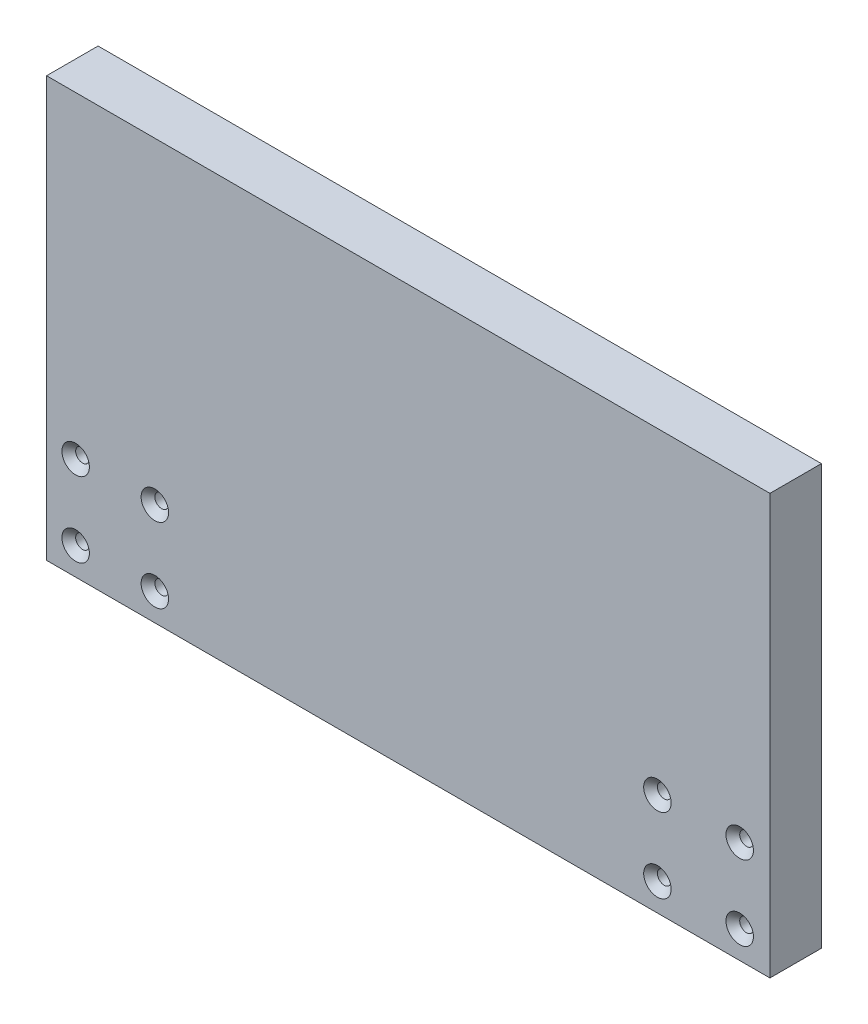
ISO-10303-21;
HEADER;
FILE_DESCRIPTION(('STEP AP214'),'2;1');
FILE_NAME('part.step','',(''),(''),'','','');
FILE_SCHEMA(('AUTOMOTIVE_DESIGN { 1 0 10303 214 1 1 1 1 }'));
ENDSEC;
DATA;
#1=APPLICATION_CONTEXT('core data for automotive mechanical design processes');
#2=APPLICATION_PROTOCOL_DEFINITION('international standard','automotive_design',2000,#1);
#3=PRODUCT_CONTEXT('',#1,'mechanical');
#4=PRODUCT('Part','Part','',(#3));
#5=PRODUCT_RELATED_PRODUCT_CATEGORY('part','',(#4));
#6=PRODUCT_DEFINITION_FORMATION('','',#4);
#7=PRODUCT_DEFINITION_CONTEXT('part definition',#1,'design');
#8=PRODUCT_DEFINITION('design','',#6,#7);
#9=PRODUCT_DEFINITION_SHAPE('','',#8);
#10=(LENGTH_UNIT() NAMED_UNIT(*) SI_UNIT(.MILLI.,.METRE.));
#11=(NAMED_UNIT(*) PLANE_ANGLE_UNIT() SI_UNIT($,.RADIAN.));
#12=(NAMED_UNIT(*) SI_UNIT($,.STERADIAN.) SOLID_ANGLE_UNIT());
#13=UNCERTAINTY_MEASURE_WITH_UNIT(LENGTH_MEASURE(1.E-05),#10,'distance_accuracy_value','');
#14=(GEOMETRIC_REPRESENTATION_CONTEXT(3) GLOBAL_UNCERTAINTY_ASSIGNED_CONTEXT((#13)) GLOBAL_UNIT_ASSIGNED_CONTEXT((#10,
#11,#12)) REPRESENTATION_CONTEXT('',''));
#15=CARTESIAN_POINT('',(0.,0.,0.));
#16=DIRECTION('',(0.,0.,1.));
#17=DIRECTION('',(1.,0.,0.));
#18=AXIS2_PLACEMENT_3D('',#15,#16,#17);
#19=CARTESIAN_POINT('',(-188.874999999999,0.,-25.4));
#20=DIRECTION('',(-1.,0.,0.));
#21=DIRECTION('',(0.,0.,1.));
#22=AXIS2_PLACEMENT_3D('',#19,#20,#21);
#23=PLANE('',#22);
#24=DIRECTION('',(0.,0.,1.));
#25=VECTOR('',#24,1.);
#26=CARTESIAN_POINT('',(-188.874999999999,194.1,-25.4));
#27=LINE('',#26,#25);
#28=CARTESIAN_POINT('',(-188.874999999999,194.1,-23.8125));
#29=VERTEX_POINT('',#28);
#30=CARTESIAN_POINT('',(-188.874999999999,194.1,0.));
#31=VERTEX_POINT('',#30);
#32=EDGE_CURVE('E135',#29,#31,#27,.T.);
#33=ORIENTED_EDGE('',*,*,#32,.F.);
#34=DIRECTION('',(0.,-1.,0.));
#35=VECTOR('',#34,1.);
#36=CARTESIAN_POINT('',(-188.874999999999,-3.86760644354291E-13,-23.8125));
#37=LINE('',#36,#35);
#38=CARTESIAN_POINT('',(-188.874999999999,-3.86760644354291E-13,-23.8125));
#39=VERTEX_POINT('',#38);
#40=EDGE_CURVE('E104',#29,#39,#37,.T.);
#41=ORIENTED_EDGE('',*,*,#40,.T.);
#42=DIRECTION('',(0.,0.,1.));
#43=VECTOR('',#42,1.);
#44=CARTESIAN_POINT('',(-188.874999999999,-3.86760644354291E-13,-25.4));
#45=LINE('',#44,#43);
#46=CARTESIAN_POINT('',(-188.874999999999,-3.86760644354291E-13,0.));
#47=VERTEX_POINT('',#46);
#48=EDGE_CURVE('E97',#39,#47,#45,.T.);
#49=ORIENTED_EDGE('',*,*,#48,.T.);
#50=DIRECTION('',(0.,-1.,0.));
#51=VECTOR('',#50,1.);
#52=CARTESIAN_POINT('',(-188.874999999999,0.,0.));
#53=LINE('',#52,#51);
#54=EDGE_CURVE('E101',#31,#47,#53,.T.);
#55=ORIENTED_EDGE('',*,*,#54,.F.);
#56=EDGE_LOOP('',(#33,#41,#49,#55));
#57=FACE_BOUND('',#56,.T.);
#58=ADVANCED_FACE('F41',(#57),#23,.T.);
#59=CARTESIAN_POINT('',(0.,194.1,-25.4));
#60=DIRECTION('',(0.,1.,0.));
#61=DIRECTION('',(-1.,0.,0.));
#62=AXIS2_PLACEMENT_3D('',#59,#60,#61);
#63=PLANE('',#62);
#64=DIRECTION('',(0.,0.,1.));
#65=VECTOR('',#64,1.);
#66=CARTESIAN_POINT('',(145.625,194.1,-25.4));
#67=LINE('',#66,#65);
#68=CARTESIAN_POINT('',(145.625,194.1,-23.8125));
#69=VERTEX_POINT('',#68);
#70=CARTESIAN_POINT('',(145.625,194.1,0.));
#71=VERTEX_POINT('',#70);
#72=EDGE_CURVE('E139',#69,#71,#67,.T.);
#73=ORIENTED_EDGE('',*,*,#72,.F.);
#74=DIRECTION('',(-1.,0.,0.));
#75=VECTOR('',#74,1.);
#76=CARTESIAN_POINT('',(-188.874999999999,194.1,-23.8125));
#77=LINE('',#76,#75);
#78=EDGE_CURVE('E11',#69,#29,#77,.T.);
#79=ORIENTED_EDGE('',*,*,#78,.T.);
#80=ORIENTED_EDGE('',*,*,#32,.T.);
#81=DIRECTION('',(-1.,0.,0.));
#82=VECTOR('',#81,1.);
#83=CARTESIAN_POINT('',(0.,194.1,0.));
#84=LINE('',#83,#82);
#85=EDGE_CURVE('E107',#71,#31,#84,.T.);
#86=ORIENTED_EDGE('',*,*,#85,.F.);
#87=EDGE_LOOP('',(#73,#79,#80,#86));
#88=FACE_BOUND('',#87,.T.);
#89=ADVANCED_FACE('F320',(#88),#63,.T.);
#90=CARTESIAN_POINT('',(145.625,0.,-25.4));
#91=DIRECTION('',(1.,0.,0.));
#92=DIRECTION('',(0.,0.,-1.));
#93=AXIS2_PLACEMENT_3D('',#90,#91,#92);
#94=PLANE('',#93);
#95=DIRECTION('',(0.,0.,1.));
#96=VECTOR('',#95,1.);
#97=CARTESIAN_POINT('',(145.625,0.,-25.4));
#98=LINE('',#97,#96);
#99=CARTESIAN_POINT('',(145.625,0.,-23.8125));
#100=VERTEX_POINT('',#99);
#101=CARTESIAN_POINT('',(145.625,0.,0.));
#102=VERTEX_POINT('',#101);
#103=EDGE_CURVE('E106',#100,#102,#98,.T.);
#104=ORIENTED_EDGE('',*,*,#103,.F.);
#105=DIRECTION('',(0.,1.,0.));
#106=VECTOR('',#105,1.);
#107=CARTESIAN_POINT('',(145.625,194.1,-23.8125));
#108=LINE('',#107,#106);
#109=EDGE_CURVE('E52',#100,#69,#108,.T.);
#110=ORIENTED_EDGE('',*,*,#109,.T.);
#111=ORIENTED_EDGE('',*,*,#72,.T.);
#112=DIRECTION('',(0.,1.,0.));
#113=VECTOR('',#112,1.);
#114=CARTESIAN_POINT('',(145.625,0.,0.));
#115=LINE('',#114,#113);
#116=EDGE_CURVE('E116',#102,#71,#115,.T.);
#117=ORIENTED_EDGE('',*,*,#116,.F.);
#118=EDGE_LOOP('',(#104,#110,#111,#117));
#119=FACE_BOUND('',#118,.T.);
#120=ADVANCED_FACE('F325',(#119),#94,.T.);
#121=CARTESIAN_POINT('',(0.,0.,-25.4));
#122=DIRECTION('',(0.,1.,0.));
#123=DIRECTION('',(0.,0.,1.));
#124=AXIS2_PLACEMENT_3D('',#121,#122,#123);
#125=PLANE('',#124);
#126=ORIENTED_EDGE('',*,*,#48,.F.);
#127=DIRECTION('',(1.,0.,0.));
#128=VECTOR('',#127,1.);
#129=CARTESIAN_POINT('',(0.,0.,-23.8125));
#130=LINE('',#129,#128);
#131=EDGE_CURVE('E67',#39,#100,#130,.T.);
#132=ORIENTED_EDGE('',*,*,#131,.T.);
#133=ORIENTED_EDGE('',*,*,#103,.T.);
#134=DIRECTION('',(-1.,0.,0.));
#135=VECTOR('',#134,1.);
#136=CARTESIAN_POINT('',(0.,0.,0.));
#137=LINE('',#136,#135);
#138=EDGE_CURVE('E110',#102,#47,#137,.T.);
#139=ORIENTED_EDGE('',*,*,#138,.T.);
#140=EDGE_LOOP('',(#126,#132,#133,#139));
#141=FACE_BOUND('',#140,.T.);
#142=ADVANCED_FACE('F111',(#141),#125,.F.);
#143=CARTESIAN_POINT('',(0.,0.,-25.4));
#144=DIRECTION('',(0.,0.,1.));
#145=DIRECTION('',(1.,0.,0.));
#146=AXIS2_PLACEMENT_3D('',#143,#144,#145);
#147=PLANE('',#146);
#148=DIRECTION('',(-1.,0.,0.));
#149=VECTOR('',#148,1.);
#150=CARTESIAN_POINT('',(0.,1.58749999999991,-25.4));
#151=LINE('',#150,#149);
#152=CARTESIAN_POINT('',(144.0375,1.58749999999991,-25.4));
#153=VERTEX_POINT('',#152);
#154=CARTESIAN_POINT('',(-187.287499999999,1.58749999999991,-25.4));
#155=VERTEX_POINT('',#154);
#156=EDGE_CURVE('E215',#153,#155,#151,.T.);
#157=ORIENTED_EDGE('',*,*,#156,.T.);
#158=DIRECTION('',(0.,1.,0.));
#159=VECTOR('',#158,1.);
#160=CARTESIAN_POINT('',(-187.287499999999,194.1,-25.4));
#161=LINE('',#160,#159);
#162=CARTESIAN_POINT('',(-187.287499999999,192.5125,-25.4));
#163=VERTEX_POINT('',#162);
#164=EDGE_CURVE('E218',#155,#163,#161,.T.);
#165=ORIENTED_EDGE('',*,*,#164,.T.);
#166=DIRECTION('',(1.,0.,0.));
#167=VECTOR('',#166,1.);
#168=CARTESIAN_POINT('',(145.625,192.5125,-25.4));
#169=LINE('',#168,#167);
#170=CARTESIAN_POINT('',(144.0375,192.5125,-25.4));
#171=VERTEX_POINT('',#170);
#172=EDGE_CURVE('E209',#163,#171,#169,.T.);
#173=ORIENTED_EDGE('',*,*,#172,.T.);
#174=DIRECTION('',(0.,-1.,0.));
#175=VECTOR('',#174,1.);
#176=CARTESIAN_POINT('',(144.0375,0.,-25.4));
#177=LINE('',#176,#175);
#178=EDGE_CURVE('E212',#171,#153,#177,.T.);
#179=ORIENTED_EDGE('',*,*,#178,.T.);
#180=EDGE_LOOP('',(#157,#165,#173,#179));
#181=FACE_BOUND('',#180,.T.);
#182=CARTESIAN_POINT('',(131.655,12.7,-25.4));
#183=DIRECTION('',(0.,0.,1.));
#184=DIRECTION('',(1.,0.,0.));
#185=AXIS2_PLACEMENT_3D('',#182,#183,#184);
#186=CIRCLE('',#185,3.175);
#187=CARTESIAN_POINT('',(134.83,12.7,-25.4));
#188=VERTEX_POINT('',#187);
#189=EDGE_CURVE('E261',#188,#188,#186,.T.);
#190=ORIENTED_EDGE('',*,*,#189,.T.);
#191=EDGE_LOOP('',(#190));
#192=FACE_BOUND('',#191,.T.);
#193=CARTESIAN_POINT('',(93.5950000000005,47.3000000000001,-25.4));
#194=DIRECTION('',(0.,0.,1.));
#195=DIRECTION('',(1.,0.,0.));
#196=AXIS2_PLACEMENT_3D('',#193,#194,#195);
#197=CIRCLE('',#196,3.175);
#198=CARTESIAN_POINT('',(96.7700000000005,47.3000000000001,-25.4));
#199=VERTEX_POINT('',#198);
#200=EDGE_CURVE('E256',#199,#199,#197,.T.);
#201=ORIENTED_EDGE('',*,*,#200,.T.);
#202=EDGE_LOOP('',(#201));
#203=FACE_BOUND('',#202,.T.);
#204=CARTESIAN_POINT('',(131.655,47.3000000000001,-25.4));
#205=DIRECTION('',(0.,0.,1.));
#206=DIRECTION('',(1.,0.,0.));
#207=AXIS2_PLACEMENT_3D('',#204,#205,#206);
#208=CIRCLE('',#207,3.175);
#209=CARTESIAN_POINT('',(134.83,47.3000000000001,-25.4));
#210=VERTEX_POINT('',#209);
#211=EDGE_CURVE('E260',#210,#210,#208,.T.);
#212=ORIENTED_EDGE('',*,*,#211,.T.);
#213=EDGE_LOOP('',(#212));
#214=FACE_BOUND('',#213,.T.);
#215=CARTESIAN_POINT('',(-138.815833333333,12.7,-25.4));
#216=DIRECTION('',(0.,0.,1.));
#217=DIRECTION('',(1.,0.,0.));
#218=AXIS2_PLACEMENT_3D('',#215,#216,#217);
#219=CIRCLE('',#218,3.175);
#220=CARTESIAN_POINT('',(-135.640833333333,12.7,-25.4));
#221=VERTEX_POINT('',#220);
#222=EDGE_CURVE('E265',#221,#221,#219,.T.);
#223=ORIENTED_EDGE('',*,*,#222,.T.);
#224=EDGE_LOOP('',(#223));
#225=FACE_BOUND('',#224,.T.);
#226=CARTESIAN_POINT('',(93.5950000000005,12.7,-25.4));
#227=DIRECTION('',(0.,0.,1.));
#228=DIRECTION('',(1.,0.,0.));
#229=AXIS2_PLACEMENT_3D('',#226,#227,#228);
#230=CIRCLE('',#229,3.175);
#231=CARTESIAN_POINT('',(96.7700000000005,12.7,-25.4));
#232=VERTEX_POINT('',#231);
#233=EDGE_CURVE('E252',#232,#232,#230,.T.);
#234=ORIENTED_EDGE('',*,*,#233,.T.);
#235=EDGE_LOOP('',(#234));
#236=FACE_BOUND('',#235,.T.);
#237=CARTESIAN_POINT('',(-175.434166666666,12.7,-25.4));
#238=DIRECTION('',(0.,0.,1.));
#239=DIRECTION('',(1.,0.,0.));
#240=AXIS2_PLACEMENT_3D('',#237,#238,#239);
#241=CIRCLE('',#240,3.175);
#242=CARTESIAN_POINT('',(-172.259166666666,12.7,-25.4));
#243=VERTEX_POINT('',#242);
#244=EDGE_CURVE('E246',#243,#243,#241,.T.);
#245=ORIENTED_EDGE('',*,*,#244,.T.);
#246=EDGE_LOOP('',(#245));
#247=FACE_BOUND('',#246,.T.);
#248=CARTESIAN_POINT('',(-175.434166666666,47.3000000000001,-25.4));
#249=DIRECTION('',(0.,0.,1.));
#250=DIRECTION('',(1.,0.,0.));
#251=AXIS2_PLACEMENT_3D('',#248,#249,#250);
#252=CIRCLE('',#251,3.175);
#253=CARTESIAN_POINT('',(-172.259166666666,47.3000000000001,-25.4));
#254=VERTEX_POINT('',#253);
#255=EDGE_CURVE('E239',#254,#254,#252,.T.);
#256=ORIENTED_EDGE('',*,*,#255,.T.);
#257=EDGE_LOOP('',(#256));
#258=FACE_BOUND('',#257,.T.);
#259=CARTESIAN_POINT('',(-138.815833333333,47.3000000000001,-25.4));
#260=DIRECTION('',(0.,0.,1.));
#261=DIRECTION('',(1.,0.,0.));
#262=AXIS2_PLACEMENT_3D('',#259,#260,#261);
#263=CIRCLE('',#262,3.175);
#264=CARTESIAN_POINT('',(-135.640833333333,47.3000000000001,-25.4));
#265=VERTEX_POINT('',#264);
#266=EDGE_CURVE('E269',#265,#265,#263,.T.);
#267=ORIENTED_EDGE('',*,*,#266,.T.);
#268=EDGE_LOOP('',(#267));
#269=FACE_BOUND('',#268,.T.);
#270=CARTESIAN_POINT('',(-112.875,30.0000000000001,-25.4));
#271=DIRECTION('',(0.,0.,1.));
#272=DIRECTION('',(1.,0.,0.));
#273=AXIS2_PLACEMENT_3D('',#270,#271,#272);
#274=CIRCLE('',#273,1.75);
#275=CARTESIAN_POINT('',(-111.125,30.0000000000001,-25.4));
#276=VERTEX_POINT('',#275);
#277=EDGE_CURVE('E125',#276,#276,#274,.T.);
#278=ORIENTED_EDGE('',*,*,#277,.T.);
#279=EDGE_LOOP('',(#278));
#280=FACE_BOUND('',#279,.T.);
#281=CARTESIAN_POINT('',(-52.8749999999997,30.0000000000001,-25.4));
#282=DIRECTION('',(0.,0.,1.));
#283=DIRECTION('',(1.,0.,0.));
#284=AXIS2_PLACEMENT_3D('',#281,#282,#283);
#285=CIRCLE('',#284,1.75);
#286=CARTESIAN_POINT('',(-51.1249999999997,30.0000000000001,-25.4));
#287=VERTEX_POINT('',#286);
#288=EDGE_CURVE('E283',#287,#287,#285,.T.);
#289=ORIENTED_EDGE('',*,*,#288,.T.);
#290=EDGE_LOOP('',(#289));
#291=FACE_BOUND('',#290,.T.);
#292=CARTESIAN_POINT('',(7.12500000000027,30.0000000000001,-25.4));
#293=DIRECTION('',(0.,0.,1.));
#294=DIRECTION('',(1.,0.,0.));
#295=AXIS2_PLACEMENT_3D('',#292,#293,#294);
#296=CIRCLE('',#295,1.75);
#297=CARTESIAN_POINT('',(8.87500000000027,30.0000000000001,-25.4));
#298=VERTEX_POINT('',#297);
#299=EDGE_CURVE('E291',#298,#298,#296,.T.);
#300=ORIENTED_EDGE('',*,*,#299,.T.);
#301=EDGE_LOOP('',(#300));
#302=FACE_BOUND('',#301,.T.);
#303=CARTESIAN_POINT('',(67.1250000000003,30.0000000000001,-25.4));
#304=DIRECTION('',(0.,0.,1.));
#305=DIRECTION('',(1.,0.,0.));
#306=AXIS2_PLACEMENT_3D('',#303,#304,#305);
#307=CIRCLE('',#306,1.75);
#308=CARTESIAN_POINT('',(68.8750000000003,30.0000000000001,-25.4));
#309=VERTEX_POINT('',#308);
#310=EDGE_CURVE('E128',#309,#309,#307,.T.);
#311=ORIENTED_EDGE('',*,*,#310,.T.);
#312=EDGE_LOOP('',(#311));
#313=FACE_BOUND('',#312,.T.);
#314=ADVANCED_FACE('F303',(#181,#192,#203,#214,#225,#236,#247,#258,#269,#280,#291,#302,#313),
#147,.F.);
#315=CARTESIAN_POINT('',(0.,0.,0.));
#316=DIRECTION('',(0.,0.,1.));
#317=DIRECTION('',(1.,0.,0.));
#318=AXIS2_PLACEMENT_3D('',#315,#316,#317);
#319=PLANE('',#318);
#320=CARTESIAN_POINT('',(-175.434166666666,47.3000000000001,0.));
#321=DIRECTION('',(0.,0.,1.));
#322=DIRECTION('',(1.,0.,0.));
#323=AXIS2_PLACEMENT_3D('',#320,#321,#322);
#324=CIRCLE('',#323,6.35000000000002);
#325=CARTESIAN_POINT('',(-169.084166666666,47.3000000000001,0.));
#326=VERTEX_POINT('',#325);
#327=EDGE_CURVE('E175',#326,#326,#324,.F.);
#328=ORIENTED_EDGE('',*,*,#327,.T.);
#329=EDGE_LOOP('',(#328));
#330=FACE_BOUND('',#329,.T.);
#331=CARTESIAN_POINT('',(-175.434166666666,12.7,0.));
#332=DIRECTION('',(0.,0.,1.));
#333=DIRECTION('',(1.,0.,0.));
#334=AXIS2_PLACEMENT_3D('',#331,#332,#333);
#335=CIRCLE('',#334,6.35000000000002);
#336=CARTESIAN_POINT('',(-169.084166666666,12.7,0.));
#337=VERTEX_POINT('',#336);
#338=EDGE_CURVE('E171',#337,#337,#335,.F.);
#339=ORIENTED_EDGE('',*,*,#338,.T.);
#340=EDGE_LOOP('',(#339));
#341=FACE_BOUND('',#340,.T.);
#342=CARTESIAN_POINT('',(93.5950000000005,47.3000000000001,0.));
#343=DIRECTION('',(0.,0.,1.));
#344=DIRECTION('',(1.,0.,0.));
#345=AXIS2_PLACEMENT_3D('',#342,#343,#344);
#346=CIRCLE('',#345,6.35000000000002);
#347=CARTESIAN_POINT('',(99.9450000000005,47.3000000000001,0.));
#348=VERTEX_POINT('',#347);
#349=EDGE_CURVE('E167',#348,#348,#346,.F.);
#350=ORIENTED_EDGE('',*,*,#349,.T.);
#351=EDGE_LOOP('',(#350));
#352=FACE_BOUND('',#351,.T.);
#353=CARTESIAN_POINT('',(131.655,47.3000000000001,0.));
#354=DIRECTION('',(0.,0.,1.));
#355=DIRECTION('',(1.,0.,0.));
#356=AXIS2_PLACEMENT_3D('',#353,#354,#355);
#357=CIRCLE('',#356,6.35000000000002);
#358=CARTESIAN_POINT('',(138.005,47.3000000000001,0.));
#359=VERTEX_POINT('',#358);
#360=EDGE_CURVE('E163',#359,#359,#357,.F.);
#361=ORIENTED_EDGE('',*,*,#360,.T.);
#362=EDGE_LOOP('',(#361));
#363=FACE_BOUND('',#362,.T.);
#364=CARTESIAN_POINT('',(131.655,12.7,0.));
#365=DIRECTION('',(0.,0.,1.));
#366=DIRECTION('',(1.,0.,0.));
#367=AXIS2_PLACEMENT_3D('',#364,#365,#366);
#368=CIRCLE('',#367,6.35000000000002);
#369=CARTESIAN_POINT('',(138.005,12.7,0.));
#370=VERTEX_POINT('',#369);
#371=EDGE_CURVE('E159',#370,#370,#368,.F.);
#372=ORIENTED_EDGE('',*,*,#371,.T.);
#373=EDGE_LOOP('',(#372));
#374=FACE_BOUND('',#373,.T.);
#375=CARTESIAN_POINT('',(93.5950000000005,12.7,0.));
#376=DIRECTION('',(0.,0.,1.));
#377=DIRECTION('',(1.,0.,0.));
#378=AXIS2_PLACEMENT_3D('',#375,#376,#377);
#379=CIRCLE('',#378,6.35000000000002);
#380=CARTESIAN_POINT('',(99.9450000000005,12.7,0.));
#381=VERTEX_POINT('',#380);
#382=EDGE_CURVE('E155',#381,#381,#379,.F.);
#383=ORIENTED_EDGE('',*,*,#382,.T.);
#384=EDGE_LOOP('',(#383));
#385=FACE_BOUND('',#384,.T.);
#386=CARTESIAN_POINT('',(-138.815833333333,12.7,0.));
#387=DIRECTION('',(0.,0.,1.));
#388=DIRECTION('',(1.,0.,0.));
#389=AXIS2_PLACEMENT_3D('',#386,#387,#388);
#390=CIRCLE('',#389,6.35000000000002);
#391=CARTESIAN_POINT('',(-132.465833333333,12.7,0.));
#392=VERTEX_POINT('',#391);
#393=EDGE_CURVE('E151',#392,#392,#390,.F.);
#394=ORIENTED_EDGE('',*,*,#393,.T.);
#395=EDGE_LOOP('',(#394));
#396=FACE_BOUND('',#395,.T.);
#397=CARTESIAN_POINT('',(-138.815833333333,47.3000000000001,0.));
#398=DIRECTION('',(0.,0.,1.));
#399=DIRECTION('',(1.,0.,0.));
#400=AXIS2_PLACEMENT_3D('',#397,#398,#399);
#401=CIRCLE('',#400,6.35000000000002);
#402=CARTESIAN_POINT('',(-132.465833333333,47.3000000000001,0.));
#403=VERTEX_POINT('',#402);
#404=EDGE_CURVE('E147',#403,#403,#401,.F.);
#405=ORIENTED_EDGE('',*,*,#404,.T.);
#406=EDGE_LOOP('',(#405));
#407=FACE_BOUND('',#406,.T.);
#408=ORIENTED_EDGE('',*,*,#54,.T.);
#409=ORIENTED_EDGE('',*,*,#138,.F.);
#410=ORIENTED_EDGE('',*,*,#116,.T.);
#411=ORIENTED_EDGE('',*,*,#85,.T.);
#412=EDGE_LOOP('',(#408,#409,#410,#411));
#413=FACE_BOUND('',#412,.T.);
#414=ADVANCED_FACE('F118',(#330,#341,#352,#363,#374,#385,#396,#407,#413),#319,.T.);
#415=CARTESIAN_POINT('',(67.1250000000003,30.0000000000001,-15.4));
#416=DIRECTION('',(0.,0.,-1.));
#417=DIRECTION('',(-1.,0.,0.));
#418=AXIS2_PLACEMENT_3D('',#415,#416,#417);
#419=CYLINDRICAL_SURFACE('',#418,1.75);
#420=CARTESIAN_POINT('',(67.1250000000003,30.0000000000001,-15.4));
#421=DIRECTION('',(0.,0.,1.));
#422=DIRECTION('',(1.,0.,0.));
#423=AXIS2_PLACEMENT_3D('',#420,#421,#422);
#424=CIRCLE('',#423,1.75);
#425=CARTESIAN_POINT('',(68.8750000000003,30.0000000000001,-15.4));
#426=VERTEX_POINT('',#425);
#427=EDGE_CURVE('E294',#426,#426,#424,.T.);
#428=ORIENTED_EDGE('',*,*,#427,.T.);
#429=EDGE_LOOP('',(#428));
#430=FACE_BOUND('',#429,.T.);
#431=ORIENTED_EDGE('',*,*,#310,.F.);
#432=EDGE_LOOP('',(#431));
#433=FACE_BOUND('',#432,.T.);
#434=ADVANCED_FACE('F305',(#430,#433),#419,.F.);
#435=CARTESIAN_POINT('',(67.1250000000003,30.0000000000001,-15.4));
#436=DIRECTION('',(0.,0.,1.));
#437=DIRECTION('',(1.,0.,0.));
#438=AXIS2_PLACEMENT_3D('',#435,#436,#437);
#439=PLANE('',#438);
#440=ORIENTED_EDGE('',*,*,#427,.F.);
#441=EDGE_LOOP('',(#440));
#442=FACE_BOUND('',#441,.T.);
#443=ADVANCED_FACE('F307',(#442),#439,.F.);
#444=CARTESIAN_POINT('',(7.12500000000027,30.0000000000001,-15.4));
#445=DIRECTION('',(0.,0.,-1.));
#446=DIRECTION('',(-1.,0.,0.));
#447=AXIS2_PLACEMENT_3D('',#444,#445,#446);
#448=CYLINDRICAL_SURFACE('',#447,1.75);
#449=CARTESIAN_POINT('',(7.12500000000027,30.0000000000001,-15.4));
#450=DIRECTION('',(0.,0.,1.));
#451=DIRECTION('',(1.,0.,0.));
#452=AXIS2_PLACEMENT_3D('',#449,#450,#451);
#453=CIRCLE('',#452,1.75);
#454=CARTESIAN_POINT('',(8.87500000000027,30.0000000000001,-15.4));
#455=VERTEX_POINT('',#454);
#456=EDGE_CURVE('E287',#455,#455,#453,.T.);
#457=ORIENTED_EDGE('',*,*,#456,.T.);
#458=EDGE_LOOP('',(#457));
#459=FACE_BOUND('',#458,.T.);
#460=ORIENTED_EDGE('',*,*,#299,.F.);
#461=EDGE_LOOP('',(#460));
#462=FACE_BOUND('',#461,.T.);
#463=ADVANCED_FACE('F313',(#459,#462),#448,.F.);
#464=CARTESIAN_POINT('',(7.12500000000027,30.0000000000001,-15.4));
#465=DIRECTION('',(0.,0.,1.));
#466=DIRECTION('',(1.,0.,0.));
#467=AXIS2_PLACEMENT_3D('',#464,#465,#466);
#468=PLANE('',#467);
#469=ORIENTED_EDGE('',*,*,#456,.F.);
#470=EDGE_LOOP('',(#469));
#471=FACE_BOUND('',#470,.T.);
#472=ADVANCED_FACE('F644',(#471),#468,.F.);
#473=CARTESIAN_POINT('',(-52.8749999999997,30.0000000000001,-15.4));
#474=DIRECTION('',(0.,0.,-1.));
#475=DIRECTION('',(-1.,0.,0.));
#476=AXIS2_PLACEMENT_3D('',#473,#474,#475);
#477=CYLINDRICAL_SURFACE('',#476,1.75);
#478=CARTESIAN_POINT('',(-52.8749999999997,30.0000000000001,-15.4));
#479=DIRECTION('',(0.,0.,1.));
#480=DIRECTION('',(1.,0.,0.));
#481=AXIS2_PLACEMENT_3D('',#478,#479,#480);
#482=CIRCLE('',#481,1.75);
#483=CARTESIAN_POINT('',(-51.1249999999997,30.0000000000001,-15.4));
#484=VERTEX_POINT('',#483);
#485=EDGE_CURVE('E279',#484,#484,#482,.T.);
#486=ORIENTED_EDGE('',*,*,#485,.T.);
#487=EDGE_LOOP('',(#486));
#488=FACE_BOUND('',#487,.T.);
#489=ORIENTED_EDGE('',*,*,#288,.F.);
#490=EDGE_LOOP('',(#489));
#491=FACE_BOUND('',#490,.T.);
#492=ADVANCED_FACE('F640',(#488,#491),#477,.F.);
#493=CARTESIAN_POINT('',(-52.8749999999997,30.0000000000001,-15.4));
#494=DIRECTION('',(0.,0.,1.));
#495=DIRECTION('',(1.,0.,0.));
#496=AXIS2_PLACEMENT_3D('',#493,#494,#495);
#497=PLANE('',#496);
#498=ORIENTED_EDGE('',*,*,#485,.F.);
#499=EDGE_LOOP('',(#498));
#500=FACE_BOUND('',#499,.T.);
#501=ADVANCED_FACE('F636',(#500),#497,.F.);
#502=CARTESIAN_POINT('',(-112.875,30.0000000000001,-15.4));
#503=DIRECTION('',(0.,0.,-1.));
#504=DIRECTION('',(-1.,0.,0.));
#505=AXIS2_PLACEMENT_3D('',#502,#503,#504);
#506=CYLINDRICAL_SURFACE('',#505,1.75);
#507=CARTESIAN_POINT('',(-112.875,30.0000000000001,-15.4));
#508=DIRECTION('',(0.,0.,1.));
#509=DIRECTION('',(1.,0.,0.));
#510=AXIS2_PLACEMENT_3D('',#507,#508,#509);
#511=CIRCLE('',#510,1.75);
#512=CARTESIAN_POINT('',(-111.125,30.0000000000001,-15.4));
#513=VERTEX_POINT('',#512);
#514=EDGE_CURVE('E121',#513,#513,#511,.T.);
#515=ORIENTED_EDGE('',*,*,#514,.T.);
#516=EDGE_LOOP('',(#515));
#517=FACE_BOUND('',#516,.T.);
#518=ORIENTED_EDGE('',*,*,#277,.F.);
#519=EDGE_LOOP('',(#518));
#520=FACE_BOUND('',#519,.T.);
#521=ADVANCED_FACE('F632',(#517,#520),#506,.F.);
#522=CARTESIAN_POINT('',(-112.875,30.0000000000001,-15.4));
#523=DIRECTION('',(0.,0.,1.));
#524=DIRECTION('',(1.,0.,0.));
#525=AXIS2_PLACEMENT_3D('',#522,#523,#524);
#526=PLANE('',#525);
#527=ORIENTED_EDGE('',*,*,#514,.F.);
#528=EDGE_LOOP('',(#527));
#529=FACE_BOUND('',#528,.T.);
#530=ADVANCED_FACE('F438',(#529),#526,.F.);
#531=CARTESIAN_POINT('',(-138.815833333333,47.3000000000001,-25.4));
#532=DIRECTION('',(0.,0.,1.));
#533=DIRECTION('',(1.,0.,0.));
#534=AXIS2_PLACEMENT_3D('',#531,#532,#533);
#535=CYLINDRICAL_SURFACE('',#534,3.175);
#536=CARTESIAN_POINT('',(-138.815833333333,47.3000000000001,-3.17499999999998));
#537=DIRECTION('',(0.,0.,1.));
#538=DIRECTION('',(1.,0.,0.));
#539=AXIS2_PLACEMENT_3D('',#536,#537,#538);
#540=CIRCLE('',#539,3.175);
#541=CARTESIAN_POINT('',(-135.640833333333,47.3000000000001,-3.17499999999998));
#542=VERTEX_POINT('',#541);
#543=EDGE_CURVE('E203',#542,#542,#540,.T.);
#544=ORIENTED_EDGE('',*,*,#543,.T.);
#545=EDGE_LOOP('',(#544));
#546=FACE_BOUND('',#545,.T.);
#547=ORIENTED_EDGE('',*,*,#266,.F.);
#548=EDGE_LOOP('',(#547));
#549=FACE_BOUND('',#548,.T.);
#550=ADVANCED_FACE('F443',(#546,#549),#535,.F.);
#551=CARTESIAN_POINT('',(-175.434166666666,47.3000000000001,-25.4));
#552=DIRECTION('',(0.,0.,1.));
#553=DIRECTION('',(1.,0.,0.));
#554=AXIS2_PLACEMENT_3D('',#551,#552,#553);
#555=CYLINDRICAL_SURFACE('',#554,3.175);
#556=CARTESIAN_POINT('',(-175.434166666666,47.3000000000001,-3.17499999999998));
#557=DIRECTION('',(0.,0.,1.));
#558=DIRECTION('',(1.,0.,0.));
#559=AXIS2_PLACEMENT_3D('',#556,#557,#558);
#560=CIRCLE('',#559,3.175);
#561=CARTESIAN_POINT('',(-172.259166666666,47.3000000000001,-3.17499999999998));
#562=VERTEX_POINT('',#561);
#563=EDGE_CURVE('E138',#562,#562,#560,.T.);
#564=ORIENTED_EDGE('',*,*,#563,.T.);
#565=EDGE_LOOP('',(#564));
#566=FACE_BOUND('',#565,.T.);
#567=ORIENTED_EDGE('',*,*,#255,.F.);
#568=EDGE_LOOP('',(#567));
#569=FACE_BOUND('',#568,.T.);
#570=ADVANCED_FACE('F448',(#566,#569),#555,.F.);
#571=CARTESIAN_POINT('',(-175.434166666666,12.7,-25.4));
#572=DIRECTION('',(0.,0.,1.));
#573=DIRECTION('',(1.,0.,0.));
#574=AXIS2_PLACEMENT_3D('',#571,#572,#573);
#575=CYLINDRICAL_SURFACE('',#574,3.175);
#576=CARTESIAN_POINT('',(-175.434166666666,12.7,-3.17499999999998));
#577=DIRECTION('',(0.,0.,1.));
#578=DIRECTION('',(1.,0.,0.));
#579=AXIS2_PLACEMENT_3D('',#576,#577,#578);
#580=CIRCLE('',#579,3.175);
#581=CARTESIAN_POINT('',(-172.259166666666,12.7,-3.17499999999998));
#582=VERTEX_POINT('',#581);
#583=EDGE_CURVE('E179',#582,#582,#580,.T.);
#584=ORIENTED_EDGE('',*,*,#583,.T.);
#585=EDGE_LOOP('',(#584));
#586=FACE_BOUND('',#585,.T.);
#587=ORIENTED_EDGE('',*,*,#244,.F.);
#588=EDGE_LOOP('',(#587));
#589=FACE_BOUND('',#588,.T.);
#590=ADVANCED_FACE('F458',(#586,#589),#575,.F.);
#591=CARTESIAN_POINT('',(93.5950000000005,12.7,-25.4));
#592=DIRECTION('',(0.,0.,1.));
#593=DIRECTION('',(1.,0.,0.));
#594=AXIS2_PLACEMENT_3D('',#591,#592,#593);
#595=CYLINDRICAL_SURFACE('',#594,3.175);
#596=CARTESIAN_POINT('',(93.5950000000005,12.7,-3.17499999999998));
#597=DIRECTION('',(0.,0.,1.));
#598=DIRECTION('',(1.,0.,0.));
#599=AXIS2_PLACEMENT_3D('',#596,#597,#598);
#600=CIRCLE('',#599,3.175);
#601=CARTESIAN_POINT('',(96.7700000000005,12.7,-3.17499999999998));
#602=VERTEX_POINT('',#601);
#603=EDGE_CURVE('E195',#602,#602,#600,.T.);
#604=ORIENTED_EDGE('',*,*,#603,.T.);
#605=EDGE_LOOP('',(#604));
#606=FACE_BOUND('',#605,.T.);
#607=ORIENTED_EDGE('',*,*,#233,.F.);
#608=EDGE_LOOP('',(#607));
#609=FACE_BOUND('',#608,.T.);
#610=ADVANCED_FACE('F468',(#606,#609),#595,.F.);
#611=CARTESIAN_POINT('',(-138.815833333333,12.7,-25.4));
#612=DIRECTION('',(0.,0.,1.));
#613=DIRECTION('',(1.,0.,0.));
#614=AXIS2_PLACEMENT_3D('',#611,#612,#613);
#615=CYLINDRICAL_SURFACE('',#614,3.175);
#616=CARTESIAN_POINT('',(-138.815833333333,12.7,-3.17499999999998));
#617=DIRECTION('',(0.,0.,1.));
#618=DIRECTION('',(1.,0.,0.));
#619=AXIS2_PLACEMENT_3D('',#616,#617,#618);
#620=CIRCLE('',#619,3.175);
#621=CARTESIAN_POINT('',(-135.640833333333,12.7,-3.17499999999998));
#622=VERTEX_POINT('',#621);
#623=EDGE_CURVE('E199',#622,#622,#620,.T.);
#624=ORIENTED_EDGE('',*,*,#623,.T.);
#625=EDGE_LOOP('',(#624));
#626=FACE_BOUND('',#625,.T.);
#627=ORIENTED_EDGE('',*,*,#222,.F.);
#628=EDGE_LOOP('',(#627));
#629=FACE_BOUND('',#628,.T.);
#630=ADVANCED_FACE('F478',(#626,#629),#615,.F.);
#631=CARTESIAN_POINT('',(131.655,47.3000000000001,-25.4));
#632=DIRECTION('',(0.,0.,1.));
#633=DIRECTION('',(1.,0.,0.));
#634=AXIS2_PLACEMENT_3D('',#631,#632,#633);
#635=CYLINDRICAL_SURFACE('',#634,3.175);
#636=CARTESIAN_POINT('',(131.655,47.3000000000001,-3.17499999999998));
#637=DIRECTION('',(0.,0.,1.));
#638=DIRECTION('',(1.,0.,0.));
#639=AXIS2_PLACEMENT_3D('',#636,#637,#638);
#640=CIRCLE('',#639,3.175);
#641=CARTESIAN_POINT('',(134.83,47.3000000000001,-3.17499999999998));
#642=VERTEX_POINT('',#641);
#643=EDGE_CURVE('E187',#642,#642,#640,.T.);
#644=ORIENTED_EDGE('',*,*,#643,.T.);
#645=EDGE_LOOP('',(#644));
#646=FACE_BOUND('',#645,.T.);
#647=ORIENTED_EDGE('',*,*,#211,.F.);
#648=EDGE_LOOP('',(#647));
#649=FACE_BOUND('',#648,.T.);
#650=ADVANCED_FACE('F488',(#646,#649),#635,.F.);
#651=CARTESIAN_POINT('',(93.5950000000005,47.3000000000001,-25.4));
#652=DIRECTION('',(0.,0.,1.));
#653=DIRECTION('',(1.,0.,0.));
#654=AXIS2_PLACEMENT_3D('',#651,#652,#653);
#655=CYLINDRICAL_SURFACE('',#654,3.175);
#656=CARTESIAN_POINT('',(93.5950000000005,47.3000000000001,-3.17499999999998));
#657=DIRECTION('',(0.,0.,1.));
#658=DIRECTION('',(1.,0.,0.));
#659=AXIS2_PLACEMENT_3D('',#656,#657,#658);
#660=CIRCLE('',#659,3.175);
#661=CARTESIAN_POINT('',(96.7700000000005,47.3000000000001,-3.17499999999998));
#662=VERTEX_POINT('',#661);
#663=EDGE_CURVE('E183',#662,#662,#660,.T.);
#664=ORIENTED_EDGE('',*,*,#663,.T.);
#665=EDGE_LOOP('',(#664));
#666=FACE_BOUND('',#665,.T.);
#667=ORIENTED_EDGE('',*,*,#200,.F.);
#668=EDGE_LOOP('',(#667));
#669=FACE_BOUND('',#668,.T.);
#670=ADVANCED_FACE('F498',(#666,#669),#655,.F.);
#671=CARTESIAN_POINT('',(131.655,12.7,-25.4));
#672=DIRECTION('',(0.,0.,1.));
#673=DIRECTION('',(1.,0.,0.));
#674=AXIS2_PLACEMENT_3D('',#671,#672,#673);
#675=CYLINDRICAL_SURFACE('',#674,3.175);
#676=CARTESIAN_POINT('',(131.655,12.7,-3.17499999999998));
#677=DIRECTION('',(0.,0.,1.));
#678=DIRECTION('',(1.,0.,0.));
#679=AXIS2_PLACEMENT_3D('',#676,#677,#678);
#680=CIRCLE('',#679,3.175);
#681=CARTESIAN_POINT('',(134.83,12.7,-3.17499999999998));
#682=VERTEX_POINT('',#681);
#683=EDGE_CURVE('E191',#682,#682,#680,.T.);
#684=ORIENTED_EDGE('',*,*,#683,.T.);
#685=EDGE_LOOP('',(#684));
#686=FACE_BOUND('',#685,.T.);
#687=ORIENTED_EDGE('',*,*,#189,.F.);
#688=EDGE_LOOP('',(#687));
#689=FACE_BOUND('',#688,.T.);
#690=ADVANCED_FACE('F339',(#686,#689),#675,.F.);
#691=CARTESIAN_POINT('',(-175.434166666666,47.3000000000001,-3.17499999999998));
#692=DIRECTION('',(0.,0.,1.));
#693=DIRECTION('',(1.,0.,0.));
#694=AXIS2_PLACEMENT_3D('',#691,#692,#693);
#695=CONICAL_SURFACE('',#694,3.175,0.785398163397455);
#696=ORIENTED_EDGE('',*,*,#327,.F.);
#697=EDGE_LOOP('',(#696));
#698=FACE_BOUND('',#697,.T.);
#699=ORIENTED_EDGE('',*,*,#563,.F.);
#700=EDGE_LOOP('',(#699));
#701=FACE_BOUND('',#700,.T.);
#702=ADVANCED_FACE('F332',(#698,#701),#695,.F.);
#703=CARTESIAN_POINT('',(-175.434166666666,12.7,-3.17499999999998));
#704=DIRECTION('',(0.,0.,1.));
#705=DIRECTION('',(1.,0.,0.));
#706=AXIS2_PLACEMENT_3D('',#703,#704,#705);
#707=CONICAL_SURFACE('',#706,3.175,0.785398163397455);
#708=ORIENTED_EDGE('',*,*,#338,.F.);
#709=EDGE_LOOP('',(#708));
#710=FACE_BOUND('',#709,.T.);
#711=ORIENTED_EDGE('',*,*,#583,.F.);
#712=EDGE_LOOP('',(#711));
#713=FACE_BOUND('',#712,.T.);
#714=ADVANCED_FACE('F338',(#710,#713),#707,.F.);
#715=CARTESIAN_POINT('',(93.5950000000005,47.3000000000001,-3.17499999999998));
#716=DIRECTION('',(0.,0.,1.));
#717=DIRECTION('',(1.,0.,0.));
#718=AXIS2_PLACEMENT_3D('',#715,#716,#717);
#719=CONICAL_SURFACE('',#718,3.175,0.785398163397455);
#720=ORIENTED_EDGE('',*,*,#349,.F.);
#721=EDGE_LOOP('',(#720));
#722=FACE_BOUND('',#721,.T.);
#723=ORIENTED_EDGE('',*,*,#663,.F.);
#724=EDGE_LOOP('',(#723));
#725=FACE_BOUND('',#724,.T.);
#726=ADVANCED_FACE('F346',(#722,#725),#719,.F.);
#727=CARTESIAN_POINT('',(131.655,47.3000000000001,-3.17499999999998));
#728=DIRECTION('',(0.,0.,1.));
#729=DIRECTION('',(1.,0.,0.));
#730=AXIS2_PLACEMENT_3D('',#727,#728,#729);
#731=CONICAL_SURFACE('',#730,3.175,0.785398163397455);
#732=ORIENTED_EDGE('',*,*,#360,.F.);
#733=EDGE_LOOP('',(#732));
#734=FACE_BOUND('',#733,.T.);
#735=ORIENTED_EDGE('',*,*,#643,.F.);
#736=EDGE_LOOP('',(#735));
#737=FACE_BOUND('',#736,.T.);
#738=ADVANCED_FACE('F353',(#734,#737),#731,.F.);
#739=CARTESIAN_POINT('',(131.655,12.7,-3.17499999999998));
#740=DIRECTION('',(0.,0.,1.));
#741=DIRECTION('',(1.,0.,0.));
#742=AXIS2_PLACEMENT_3D('',#739,#740,#741);
#743=CONICAL_SURFACE('',#742,3.175,0.785398163397455);
#744=ORIENTED_EDGE('',*,*,#371,.F.);
#745=EDGE_LOOP('',(#744));
#746=FACE_BOUND('',#745,.T.);
#747=ORIENTED_EDGE('',*,*,#683,.F.);
#748=EDGE_LOOP('',(#747));
#749=FACE_BOUND('',#748,.T.);
#750=ADVANCED_FACE('F360',(#746,#749),#743,.F.);
#751=CARTESIAN_POINT('',(93.5950000000005,12.7,-3.17499999999998));
#752=DIRECTION('',(0.,0.,1.));
#753=DIRECTION('',(1.,0.,0.));
#754=AXIS2_PLACEMENT_3D('',#751,#752,#753);
#755=CONICAL_SURFACE('',#754,3.175,0.785398163397455);
#756=ORIENTED_EDGE('',*,*,#382,.F.);
#757=EDGE_LOOP('',(#756));
#758=FACE_BOUND('',#757,.T.);
#759=ORIENTED_EDGE('',*,*,#603,.F.);
#760=EDGE_LOOP('',(#759));
#761=FACE_BOUND('',#760,.T.);
#762=ADVANCED_FACE('F367',(#758,#761),#755,.F.);
#763=CARTESIAN_POINT('',(-138.815833333333,12.7,-3.17499999999998));
#764=DIRECTION('',(0.,0.,1.));
#765=DIRECTION('',(1.,0.,0.));
#766=AXIS2_PLACEMENT_3D('',#763,#764,#765);
#767=CONICAL_SURFACE('',#766,3.175,0.785398163397455);
#768=ORIENTED_EDGE('',*,*,#393,.F.);
#769=EDGE_LOOP('',(#768));
#770=FACE_BOUND('',#769,.T.);
#771=ORIENTED_EDGE('',*,*,#623,.F.);
#772=EDGE_LOOP('',(#771));
#773=FACE_BOUND('',#772,.T.);
#774=ADVANCED_FACE('F374',(#770,#773),#767,.F.);
#775=CARTESIAN_POINT('',(-138.815833333333,47.3000000000001,-3.17499999999998));
#776=DIRECTION('',(0.,0.,1.));
#777=DIRECTION('',(1.,0.,0.));
#778=AXIS2_PLACEMENT_3D('',#775,#776,#777);
#779=CONICAL_SURFACE('',#778,3.175,0.785398163397455);
#780=ORIENTED_EDGE('',*,*,#404,.F.);
#781=EDGE_LOOP('',(#780));
#782=FACE_BOUND('',#781,.T.);
#783=ORIENTED_EDGE('',*,*,#543,.F.);
#784=EDGE_LOOP('',(#783));
#785=FACE_BOUND('',#784,.T.);
#786=ADVANCED_FACE('F381',(#782,#785),#779,.F.);
#787=CARTESIAN_POINT('',(145.625,0.,-23.8125));
#788=DIRECTION('',(0.70710678118656,0.,-0.707106781186535));
#789=DIRECTION('',(0.,-1.,0.));
#790=AXIS2_PLACEMENT_3D('',#787,#788,#789);
#791=PLANE('',#790);
#792=DIRECTION('',(0.577350269189619,-0.577350269189619,0.577350269189639));
#793=VECTOR('',#792,1.);
#794=CARTESIAN_POINT('',(145.625,0.,-23.8125));
#795=LINE('',#794,#793);
#796=EDGE_CURVE('E231',#153,#100,#795,.T.);
#797=ORIENTED_EDGE('',*,*,#796,.F.);
#798=ORIENTED_EDGE('',*,*,#178,.F.);
#799=DIRECTION('',(-0.577350269189619,-0.577350269189619,-0.577350269189639));
#800=VECTOR('',#799,1.);
#801=CARTESIAN_POINT('',(97.0833333333346,145.558333333334,-72.3541666666674));
#802=LINE('',#801,#800);
#803=EDGE_CURVE('E46',#69,#171,#802,.T.);
#804=ORIENTED_EDGE('',*,*,#803,.F.);
#805=ORIENTED_EDGE('',*,*,#109,.F.);
#806=EDGE_LOOP('',(#797,#798,#804,#805));
#807=FACE_BOUND('',#806,.T.);
#808=ADVANCED_FACE('F44',(#807),#791,.T.);
#809=CARTESIAN_POINT('',(0.,194.1,-23.8125));
#810=DIRECTION('',(0.,0.70710678118656,-0.707106781186535));
#811=DIRECTION('',(1.,0.,0.));
#812=AXIS2_PLACEMENT_3D('',#809,#810,#811);
#813=PLANE('',#812);
#814=ORIENTED_EDGE('',*,*,#803,.T.);
#815=ORIENTED_EDGE('',*,*,#172,.F.);
#816=DIRECTION('',(-0.577350269189619,0.577350269189619,0.577350269189639));
#817=VECTOR('',#816,1.);
#818=CARTESIAN_POINT('',(-125.916666666668,131.141666666668,-86.7708333333339));
#819=LINE('',#818,#817);
#820=EDGE_CURVE('E229',#29,#163,#819,.F.);
#821=ORIENTED_EDGE('',*,*,#820,.F.);
#822=ORIENTED_EDGE('',*,*,#78,.F.);
#823=EDGE_LOOP('',(#814,#815,#821,#822));
#824=FACE_BOUND('',#823,.T.);
#825=ADVANCED_FACE('F401',(#824),#813,.T.);
#826=CARTESIAN_POINT('',(0.,1.58749999999991,-25.4));
#827=DIRECTION('',(0.,0.70710678118656,0.707106781186535));
#828=DIRECTION('',(-1.,0.,0.));
#829=AXIS2_PLACEMENT_3D('',#826,#827,#828);
#830=PLANE('',#829);
#831=ORIENTED_EDGE('',*,*,#796,.T.);
#832=ORIENTED_EDGE('',*,*,#131,.F.);
#833=DIRECTION('',(-0.577350269189619,-0.577350269189619,0.577350269189639));
#834=VECTOR('',#833,1.);
#835=CARTESIAN_POINT('',(-124.858333333334,64.0166666666649,-87.8291666666672));
#836=LINE('',#835,#834);
#837=EDGE_CURVE('E226',#155,#39,#836,.T.);
#838=ORIENTED_EDGE('',*,*,#837,.F.);
#839=ORIENTED_EDGE('',*,*,#156,.F.);
#840=EDGE_LOOP('',(#831,#832,#838,#839));
#841=FACE_BOUND('',#840,.T.);
#842=ADVANCED_FACE('F395',(#841),#830,.F.);
#843=CARTESIAN_POINT('',(-188.874999999999,0.,-23.8125));
#844=DIRECTION('',(-0.70710678118656,0.,-0.707106781186535));
#845=DIRECTION('',(0.,1.,0.));
#846=AXIS2_PLACEMENT_3D('',#843,#844,#845);
#847=PLANE('',#846);
#848=ORIENTED_EDGE('',*,*,#820,.T.);
#849=ORIENTED_EDGE('',*,*,#164,.F.);
#850=ORIENTED_EDGE('',*,*,#837,.T.);
#851=ORIENTED_EDGE('',*,*,#40,.F.);
#852=EDGE_LOOP('',(#848,#849,#850,#851));
#853=FACE_BOUND('',#852,.T.);
#854=ADVANCED_FACE('F389',(#853),#847,.T.);
#855=CLOSED_SHELL('',(#58,#89,#120,#142,#314,#414,#434,#443,#463,#472,#492,#501,#521,#530,#550,
#570,#590,#610,#630,#650,#670,#690,#702,#714,#726,#738,#750,#762,#774,#786,#808,#825,#842,#854));
#856=MANIFOLD_SOLID_BREP('B2',#855);
#857=ADVANCED_BREP_SHAPE_REPRESENTATION('',(#18,#856),#14);
#858=SHAPE_DEFINITION_REPRESENTATION(#9,#857);
ENDSEC;
END-ISO-10303-21;
